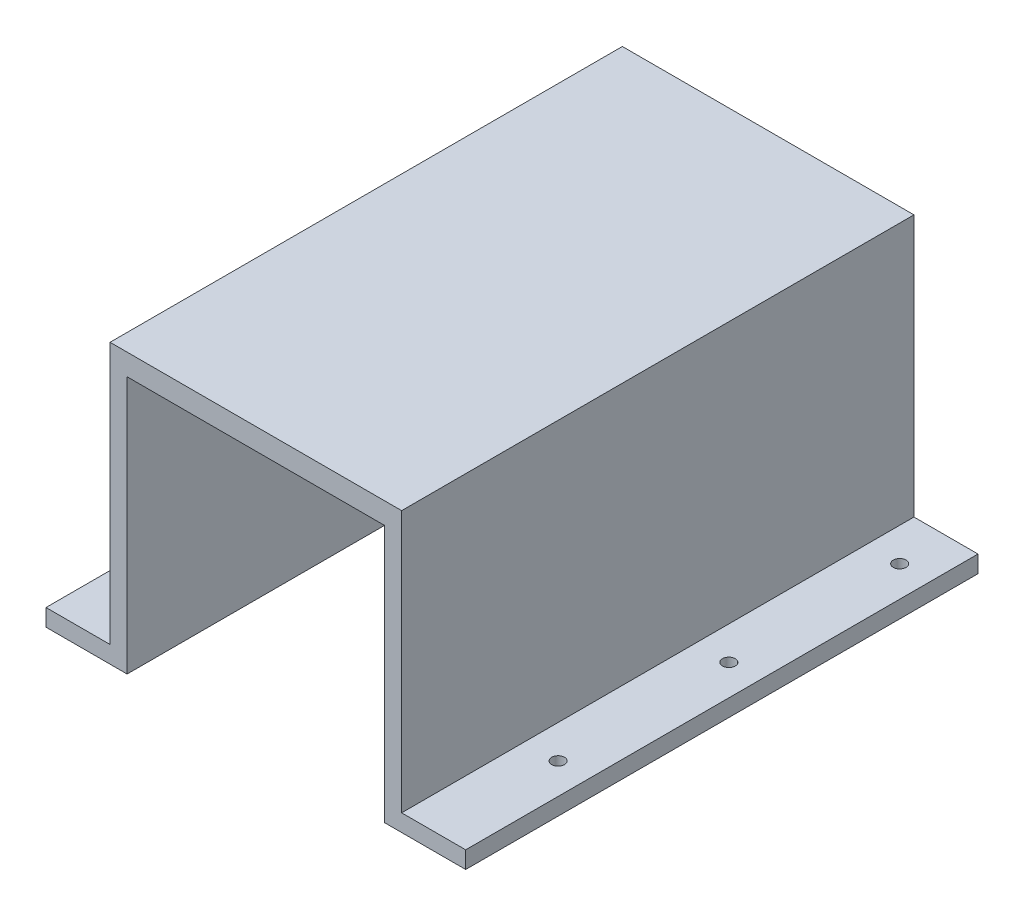
ISO-10303-21;
HEADER;
FILE_DESCRIPTION(('STEP AP214'),'2;1');
FILE_NAME('part.step','',(''),(''),'','','');
FILE_SCHEMA(('AUTOMOTIVE_DESIGN { 1 0 10303 214 1 1 1 1 }'));
ENDSEC;
DATA;
#1=APPLICATION_CONTEXT('core data for automotive mechanical design processes');
#2=APPLICATION_PROTOCOL_DEFINITION('international standard','automotive_design',2000,#1);
#3=PRODUCT_CONTEXT('',#1,'mechanical');
#4=PRODUCT('Part','Part','',(#3));
#5=PRODUCT_RELATED_PRODUCT_CATEGORY('part','',(#4));
#6=PRODUCT_DEFINITION_FORMATION('','',#4);
#7=PRODUCT_DEFINITION_CONTEXT('part definition',#1,'design');
#8=PRODUCT_DEFINITION('design','',#6,#7);
#9=PRODUCT_DEFINITION_SHAPE('','',#8);
#10=(LENGTH_UNIT() NAMED_UNIT(*) SI_UNIT(.MILLI.,.METRE.));
#11=(NAMED_UNIT(*) PLANE_ANGLE_UNIT() SI_UNIT($,.RADIAN.));
#12=(NAMED_UNIT(*) SI_UNIT($,.STERADIAN.) SOLID_ANGLE_UNIT());
#13=UNCERTAINTY_MEASURE_WITH_UNIT(LENGTH_MEASURE(1.E-05),#10,'distance_accuracy_value','');
#14=(GEOMETRIC_REPRESENTATION_CONTEXT(3) GLOBAL_UNCERTAINTY_ASSIGNED_CONTEXT((#13)) GLOBAL_UNIT_ASSIGNED_CONTEXT((#10,
#11,#12)) REPRESENTATION_CONTEXT('',''));
#15=CARTESIAN_POINT('',(0.,0.,0.));
#16=DIRECTION('',(0.,0.,1.));
#17=DIRECTION('',(1.,0.,0.));
#18=AXIS2_PLACEMENT_3D('',#15,#16,#17);
#19=CARTESIAN_POINT('',(-49.15,4.,-60.));
#20=DIRECTION('',(-1.,0.,0.));
#21=DIRECTION('',(0.,0.,1.));
#22=AXIS2_PLACEMENT_3D('',#19,#20,#21);
#23=PLANE('',#22);
#24=DIRECTION('',(0.,0.,1.));
#25=VECTOR('',#24,1.);
#26=CARTESIAN_POINT('',(-49.15,0.,-60.));
#27=LINE('',#26,#25);
#28=CARTESIAN_POINT('',(-49.15,0.,-60.));
#29=VERTEX_POINT('',#28);
#30=CARTESIAN_POINT('',(-49.15,0.,60.));
#31=VERTEX_POINT('',#30);
#32=EDGE_CURVE('E11',#29,#31,#27,.T.);
#33=ORIENTED_EDGE('',*,*,#32,.T.);
#34=DIRECTION('',(0.,-1.,0.));
#35=VECTOR('',#34,1.);
#36=CARTESIAN_POINT('',(-49.15,4.,60.));
#37=LINE('',#36,#35);
#38=CARTESIAN_POINT('',(-49.15,4.,60.));
#39=VERTEX_POINT('',#38);
#40=EDGE_CURVE('E138',#39,#31,#37,.T.);
#41=ORIENTED_EDGE('',*,*,#40,.F.);
#42=DIRECTION('',(0.,0.,1.));
#43=VECTOR('',#42,1.);
#44=CARTESIAN_POINT('',(-49.15,4.,-60.));
#45=LINE('',#44,#43);
#46=CARTESIAN_POINT('',(-49.15,4.,-60.));
#47=VERTEX_POINT('',#46);
#48=EDGE_CURVE('E43',#47,#39,#45,.T.);
#49=ORIENTED_EDGE('',*,*,#48,.F.);
#50=DIRECTION('',(0.,-1.,0.));
#51=VECTOR('',#50,1.);
#52=CARTESIAN_POINT('',(-49.15,4.,-60.));
#53=LINE('',#52,#51);
#54=EDGE_CURVE('E129',#47,#29,#53,.T.);
#55=ORIENTED_EDGE('',*,*,#54,.T.);
#56=EDGE_LOOP('',(#33,#41,#49,#55));
#57=FACE_BOUND('',#56,.T.);
#58=ADVANCED_FACE('F34',(#57),#23,.T.);
#59=CARTESIAN_POINT('',(-34.15,4.,-60.));
#60=DIRECTION('',(0.,1.,0.));
#61=DIRECTION('',(0.,0.,1.));
#62=AXIS2_PLACEMENT_3D('',#59,#60,#61);
#63=PLANE('',#62);
#64=CARTESIAN_POINT('',(-41.9465676307595,4.,31.14843605141));
#65=DIRECTION('',(0.,-1.,0.));
#66=DIRECTION('',(0.,0.,1.));
#67=AXIS2_PLACEMENT_3D('',#64,#65,#66);
#68=CIRCLE('',#67,1.5);
#69=CARTESIAN_POINT('',(-41.9465676307595,4.,32.64843605141));
#70=VERTEX_POINT('',#69);
#71=EDGE_CURVE('E328',#70,#70,#68,.T.);
#72=ORIENTED_EDGE('',*,*,#71,.T.);
#73=EDGE_LOOP('',(#72));
#74=FACE_BOUND('',#73,.T.);
#75=CARTESIAN_POINT('',(-41.9465676307595,4.,-8.85156394858996));
#76=DIRECTION('',(0.,-1.,0.));
#77=DIRECTION('',(0.,0.,1.));
#78=AXIS2_PLACEMENT_3D('',#75,#76,#77);
#79=CIRCLE('',#78,1.5);
#80=CARTESIAN_POINT('',(-41.9465676307595,4.,-7.35156394858995));
#81=VERTEX_POINT('',#80);
#82=EDGE_CURVE('E302',#81,#81,#79,.T.);
#83=ORIENTED_EDGE('',*,*,#82,.T.);
#84=EDGE_LOOP('',(#83));
#85=FACE_BOUND('',#84,.T.);
#86=CARTESIAN_POINT('',(-41.9465676307595,4.,-48.85156394859));
#87=DIRECTION('',(0.,-1.,0.));
#88=DIRECTION('',(0.,0.,1.));
#89=AXIS2_PLACEMENT_3D('',#86,#87,#88);
#90=CIRCLE('',#89,1.5);
#91=CARTESIAN_POINT('',(-41.9465676307595,4.,-47.35156394859));
#92=VERTEX_POINT('',#91);
#93=EDGE_CURVE('E303',#92,#92,#90,.T.);
#94=ORIENTED_EDGE('',*,*,#93,.T.);
#95=EDGE_LOOP('',(#94));
#96=FACE_BOUND('',#95,.T.);
#97=ORIENTED_EDGE('',*,*,#48,.T.);
#98=DIRECTION('',(-1.,0.,0.));
#99=VECTOR('',#98,1.);
#100=CARTESIAN_POINT('',(-34.15,4.,60.));
#101=LINE('',#100,#99);
#102=CARTESIAN_POINT('',(-34.15,4.,60.));
#103=VERTEX_POINT('',#102);
#104=EDGE_CURVE('E168',#103,#39,#101,.T.);
#105=ORIENTED_EDGE('',*,*,#104,.F.);
#106=DIRECTION('',(0.,0.,1.));
#107=VECTOR('',#106,1.);
#108=CARTESIAN_POINT('',(-34.15,4.,-60.));
#109=LINE('',#108,#107);
#110=CARTESIAN_POINT('',(-34.15,4.,-60.));
#111=VERTEX_POINT('',#110);
#112=EDGE_CURVE('E201',#111,#103,#109,.T.);
#113=ORIENTED_EDGE('',*,*,#112,.F.);
#114=DIRECTION('',(-1.,0.,0.));
#115=VECTOR('',#114,1.);
#116=CARTESIAN_POINT('',(-34.15,4.,-60.));
#117=LINE('',#116,#115);
#118=EDGE_CURVE('E197',#111,#47,#117,.T.);
#119=ORIENTED_EDGE('',*,*,#118,.T.);
#120=EDGE_LOOP('',(#97,#105,#113,#119));
#121=FACE_BOUND('',#120,.T.);
#122=ADVANCED_FACE('F253',(#74,#85,#96,#121),#63,.T.);
#123=CARTESIAN_POINT('',(-34.15,4.,-60.));
#124=DIRECTION('',(-1.,0.,0.));
#125=DIRECTION('',(0.,0.,1.));
#126=AXIS2_PLACEMENT_3D('',#123,#124,#125);
#127=PLANE('',#126);
#128=ORIENTED_EDGE('',*,*,#112,.T.);
#129=DIRECTION('',(0.,-1.,0.));
#130=VECTOR('',#129,1.);
#131=CARTESIAN_POINT('',(-34.15,4.,60.));
#132=LINE('',#131,#130);
#133=CARTESIAN_POINT('',(-34.15,65.3,60.));
#134=VERTEX_POINT('',#133);
#135=EDGE_CURVE('E165',#134,#103,#132,.T.);
#136=ORIENTED_EDGE('',*,*,#135,.F.);
#137=DIRECTION('',(0.,0.,1.));
#138=VECTOR('',#137,1.);
#139=CARTESIAN_POINT('',(-34.15,65.3,-60.));
#140=LINE('',#139,#138);
#141=CARTESIAN_POINT('',(-34.15,65.3,-60.));
#142=VERTEX_POINT('',#141);
#143=EDGE_CURVE('E203',#142,#134,#140,.T.);
#144=ORIENTED_EDGE('',*,*,#143,.F.);
#145=DIRECTION('',(0.,-1.,0.));
#146=VECTOR('',#145,1.);
#147=CARTESIAN_POINT('',(-34.15,4.,-60.));
#148=LINE('',#147,#146);
#149=EDGE_CURVE('E194',#142,#111,#148,.T.);
#150=ORIENTED_EDGE('',*,*,#149,.T.);
#151=EDGE_LOOP('',(#128,#136,#144,#150));
#152=FACE_BOUND('',#151,.T.);
#153=ADVANCED_FACE('F251',(#152),#127,.T.);
#154=CARTESIAN_POINT('',(-34.15,65.3,-60.));
#155=DIRECTION('',(0.,1.,0.));
#156=DIRECTION('',(-1.,0.,0.));
#157=AXIS2_PLACEMENT_3D('',#154,#155,#156);
#158=PLANE('',#157);
#159=ORIENTED_EDGE('',*,*,#143,.T.);
#160=DIRECTION('',(-1.,0.,0.));
#161=VECTOR('',#160,1.);
#162=CARTESIAN_POINT('',(-34.15,65.3,60.));
#163=LINE('',#162,#161);
#164=CARTESIAN_POINT('',(34.15,65.3,60.));
#165=VERTEX_POINT('',#164);
#166=EDGE_CURVE('E162',#165,#134,#163,.T.);
#167=ORIENTED_EDGE('',*,*,#166,.F.);
#168=DIRECTION('',(0.,0.,1.));
#169=VECTOR('',#168,1.);
#170=CARTESIAN_POINT('',(34.15,65.3,-60.));
#171=LINE('',#170,#169);
#172=CARTESIAN_POINT('',(34.15,65.3,-60.));
#173=VERTEX_POINT('',#172);
#174=EDGE_CURVE('E205',#173,#165,#171,.T.);
#175=ORIENTED_EDGE('',*,*,#174,.F.);
#176=DIRECTION('',(-1.,0.,0.));
#177=VECTOR('',#176,1.);
#178=CARTESIAN_POINT('',(-34.15,65.3,-60.));
#179=LINE('',#178,#177);
#180=EDGE_CURVE('E191',#173,#142,#179,.T.);
#181=ORIENTED_EDGE('',*,*,#180,.T.);
#182=EDGE_LOOP('',(#159,#167,#175,#181));
#183=FACE_BOUND('',#182,.T.);
#184=ADVANCED_FACE('F246',(#183),#158,.T.);
#185=CARTESIAN_POINT('',(34.15,4.,-60.));
#186=DIRECTION('',(1.,0.,0.));
#187=DIRECTION('',(0.,0.,-1.));
#188=AXIS2_PLACEMENT_3D('',#185,#186,#187);
#189=PLANE('',#188);
#190=ORIENTED_EDGE('',*,*,#174,.T.);
#191=DIRECTION('',(0.,1.,0.));
#192=VECTOR('',#191,1.);
#193=CARTESIAN_POINT('',(34.15,4.,60.));
#194=LINE('',#193,#192);
#195=CARTESIAN_POINT('',(34.15,4.,60.));
#196=VERTEX_POINT('',#195);
#197=EDGE_CURVE('E159',#196,#165,#194,.T.);
#198=ORIENTED_EDGE('',*,*,#197,.F.);
#199=DIRECTION('',(0.,0.,1.));
#200=VECTOR('',#199,1.);
#201=CARTESIAN_POINT('',(34.15,4.,-60.));
#202=LINE('',#201,#200);
#203=CARTESIAN_POINT('',(34.15,4.,-60.));
#204=VERTEX_POINT('',#203);
#205=EDGE_CURVE('E207',#204,#196,#202,.T.);
#206=ORIENTED_EDGE('',*,*,#205,.F.);
#207=DIRECTION('',(0.,1.,0.));
#208=VECTOR('',#207,1.);
#209=CARTESIAN_POINT('',(34.15,4.,-60.));
#210=LINE('',#209,#208);
#211=EDGE_CURVE('E188',#204,#173,#210,.T.);
#212=ORIENTED_EDGE('',*,*,#211,.T.);
#213=EDGE_LOOP('',(#190,#198,#206,#212));
#214=FACE_BOUND('',#213,.T.);
#215=ADVANCED_FACE('F241',(#214),#189,.T.);
#216=CARTESIAN_POINT('',(34.15,4.,-60.));
#217=DIRECTION('',(0.,1.,0.));
#218=DIRECTION('',(0.,0.,1.));
#219=AXIS2_PLACEMENT_3D('',#216,#217,#218);
#220=PLANE('',#219);
#221=CARTESIAN_POINT('',(41.9465676307595,4.,31.14843605141));
#222=DIRECTION('',(0.,1.,0.));
#223=DIRECTION('',(0.,0.,1.));
#224=AXIS2_PLACEMENT_3D('',#221,#222,#223);
#225=CIRCLE('',#224,1.5);
#226=CARTESIAN_POINT('',(41.9465676307595,4.,32.64843605141));
#227=VERTEX_POINT('',#226);
#228=EDGE_CURVE('E313',#227,#227,#225,.T.);
#229=ORIENTED_EDGE('',*,*,#228,.F.);
#230=EDGE_LOOP('',(#229));
#231=FACE_BOUND('',#230,.T.);
#232=CARTESIAN_POINT('',(41.9465676307595,4.,-8.85156394858996));
#233=DIRECTION('',(0.,1.,0.));
#234=DIRECTION('',(0.,0.,1.));
#235=AXIS2_PLACEMENT_3D('',#232,#233,#234);
#236=CIRCLE('',#235,1.5);
#237=CARTESIAN_POINT('',(41.9465676307595,4.,-7.35156394858995));
#238=VERTEX_POINT('',#237);
#239=EDGE_CURVE('E319',#238,#238,#236,.T.);
#240=ORIENTED_EDGE('',*,*,#239,.F.);
#241=EDGE_LOOP('',(#240));
#242=FACE_BOUND('',#241,.T.);
#243=CARTESIAN_POINT('',(41.9465676307595,4.,-48.85156394859));
#244=DIRECTION('',(0.,1.,0.));
#245=DIRECTION('',(0.,0.,1.));
#246=AXIS2_PLACEMENT_3D('',#243,#244,#245);
#247=CIRCLE('',#246,1.5);
#248=CARTESIAN_POINT('',(41.9465676307595,4.,-47.35156394859));
#249=VERTEX_POINT('',#248);
#250=EDGE_CURVE('E324',#249,#249,#247,.T.);
#251=ORIENTED_EDGE('',*,*,#250,.F.);
#252=EDGE_LOOP('',(#251));
#253=FACE_BOUND('',#252,.T.);
#254=ORIENTED_EDGE('',*,*,#205,.T.);
#255=DIRECTION('',(-1.,0.,0.));
#256=VECTOR('',#255,1.);
#257=CARTESIAN_POINT('',(34.15,4.,60.));
#258=LINE('',#257,#256);
#259=CARTESIAN_POINT('',(49.15,4.,60.));
#260=VERTEX_POINT('',#259);
#261=EDGE_CURVE('E156',#260,#196,#258,.T.);
#262=ORIENTED_EDGE('',*,*,#261,.F.);
#263=DIRECTION('',(0.,0.,1.));
#264=VECTOR('',#263,1.);
#265=CARTESIAN_POINT('',(49.15,4.,-60.));
#266=LINE('',#265,#264);
#267=CARTESIAN_POINT('',(49.15,4.,-60.));
#268=VERTEX_POINT('',#267);
#269=EDGE_CURVE('E209',#268,#260,#266,.T.);
#270=ORIENTED_EDGE('',*,*,#269,.F.);
#271=DIRECTION('',(-1.,0.,0.));
#272=VECTOR('',#271,1.);
#273=CARTESIAN_POINT('',(34.15,4.,-60.));
#274=LINE('',#273,#272);
#275=EDGE_CURVE('E185',#268,#204,#274,.T.);
#276=ORIENTED_EDGE('',*,*,#275,.T.);
#277=EDGE_LOOP('',(#254,#262,#270,#276));
#278=FACE_BOUND('',#277,.T.);
#279=ADVANCED_FACE('F239',(#231,#242,#253,#278),#220,.T.);
#280=CARTESIAN_POINT('',(49.15,4.,-60.));
#281=DIRECTION('',(1.,0.,0.));
#282=DIRECTION('',(0.,0.,-1.));
#283=AXIS2_PLACEMENT_3D('',#280,#281,#282);
#284=PLANE('',#283);
#285=ORIENTED_EDGE('',*,*,#269,.T.);
#286=DIRECTION('',(0.,1.,0.));
#287=VECTOR('',#286,1.);
#288=CARTESIAN_POINT('',(49.15,4.,60.));
#289=LINE('',#288,#287);
#290=CARTESIAN_POINT('',(49.15,0.,60.));
#291=VERTEX_POINT('',#290);
#292=EDGE_CURVE('E153',#291,#260,#289,.T.);
#293=ORIENTED_EDGE('',*,*,#292,.F.);
#294=DIRECTION('',(0.,0.,1.));
#295=VECTOR('',#294,1.);
#296=CARTESIAN_POINT('',(49.15,0.,-60.));
#297=LINE('',#296,#295);
#298=CARTESIAN_POINT('',(49.15,0.,-60.));
#299=VERTEX_POINT('',#298);
#300=EDGE_CURVE('E211',#299,#291,#297,.T.);
#301=ORIENTED_EDGE('',*,*,#300,.F.);
#302=DIRECTION('',(0.,1.,0.));
#303=VECTOR('',#302,1.);
#304=CARTESIAN_POINT('',(49.15,4.,-60.));
#305=LINE('',#304,#303);
#306=EDGE_CURVE('E182',#299,#268,#305,.T.);
#307=ORIENTED_EDGE('',*,*,#306,.T.);
#308=EDGE_LOOP('',(#285,#293,#301,#307));
#309=FACE_BOUND('',#308,.T.);
#310=ADVANCED_FACE('F234',(#309),#284,.T.);
#311=CARTESIAN_POINT('',(49.15,0.,-60.));
#312=DIRECTION('',(0.,-1.,0.));
#313=DIRECTION('',(0.,0.,-1.));
#314=AXIS2_PLACEMENT_3D('',#311,#312,#313);
#315=PLANE('',#314);
#316=CARTESIAN_POINT('',(41.9465676307595,0.,31.14843605141));
#317=DIRECTION('',(0.,1.,0.));
#318=DIRECTION('',(0.,0.,1.));
#319=AXIS2_PLACEMENT_3D('',#316,#317,#318);
#320=CIRCLE('',#319,1.5);
#321=CARTESIAN_POINT('',(41.9465676307595,0.,32.64843605141));
#322=VERTEX_POINT('',#321);
#323=EDGE_CURVE('E139',#322,#322,#320,.T.);
#324=ORIENTED_EDGE('',*,*,#323,.T.);
#325=EDGE_LOOP('',(#324));
#326=FACE_BOUND('',#325,.T.);
#327=CARTESIAN_POINT('',(41.9465676307595,0.,-8.85156394858996));
#328=DIRECTION('',(0.,1.,0.));
#329=DIRECTION('',(0.,0.,1.));
#330=AXIS2_PLACEMENT_3D('',#327,#328,#329);
#331=CIRCLE('',#330,1.5);
#332=CARTESIAN_POINT('',(41.9465676307595,0.,-7.35156394858995));
#333=VERTEX_POINT('',#332);
#334=EDGE_CURVE('E316',#333,#333,#331,.T.);
#335=ORIENTED_EDGE('',*,*,#334,.T.);
#336=EDGE_LOOP('',(#335));
#337=FACE_BOUND('',#336,.T.);
#338=CARTESIAN_POINT('',(41.9465676307595,0.,-48.85156394859));
#339=DIRECTION('',(0.,1.,0.));
#340=DIRECTION('',(0.,0.,1.));
#341=AXIS2_PLACEMENT_3D('',#338,#339,#340);
#342=CIRCLE('',#341,1.5);
#343=CARTESIAN_POINT('',(41.9465676307595,0.,-47.35156394859));
#344=VERTEX_POINT('',#343);
#345=EDGE_CURVE('E322',#344,#344,#342,.T.);
#346=ORIENTED_EDGE('',*,*,#345,.T.);
#347=EDGE_LOOP('',(#346));
#348=FACE_BOUND('',#347,.T.);
#349=ORIENTED_EDGE('',*,*,#300,.T.);
#350=DIRECTION('',(1.,0.,0.));
#351=VECTOR('',#350,1.);
#352=CARTESIAN_POINT('',(34.15,0.,60.));
#353=LINE('',#352,#351);
#354=CARTESIAN_POINT('',(30.15,0.,60.));
#355=VERTEX_POINT('',#354);
#356=EDGE_CURVE('E150',#355,#291,#353,.T.);
#357=ORIENTED_EDGE('',*,*,#356,.F.);
#358=DIRECTION('',(0.,0.,1.));
#359=VECTOR('',#358,1.);
#360=CARTESIAN_POINT('',(30.15,0.,-60.));
#361=LINE('',#360,#359);
#362=CARTESIAN_POINT('',(30.15,0.,-60.));
#363=VERTEX_POINT('',#362);
#364=EDGE_CURVE('E213',#363,#355,#361,.T.);
#365=ORIENTED_EDGE('',*,*,#364,.F.);
#366=DIRECTION('',(1.,0.,0.));
#367=VECTOR('',#366,1.);
#368=CARTESIAN_POINT('',(34.15,0.,-60.));
#369=LINE('',#368,#367);
#370=EDGE_CURVE('E180',#363,#299,#369,.T.);
#371=ORIENTED_EDGE('',*,*,#370,.T.);
#372=EDGE_LOOP('',(#349,#357,#365,#371));
#373=FACE_BOUND('',#372,.T.);
#374=ADVANCED_FACE('F226',(#326,#337,#348,#373),#315,.T.);
#375=CARTESIAN_POINT('',(30.15,0.,-60.));
#376=DIRECTION('',(-1.,0.,0.));
#377=DIRECTION('',(0.,0.,1.));
#378=AXIS2_PLACEMENT_3D('',#375,#376,#377);
#379=PLANE('',#378);
#380=ORIENTED_EDGE('',*,*,#364,.T.);
#381=DIRECTION('',(0.,-1.,0.));
#382=VECTOR('',#381,1.);
#383=CARTESIAN_POINT('',(30.15,0.,60.));
#384=LINE('',#383,#382);
#385=CARTESIAN_POINT('',(30.15,60.3,60.));
#386=VERTEX_POINT('',#385);
#387=EDGE_CURVE('E144',#386,#355,#384,.T.);
#388=ORIENTED_EDGE('',*,*,#387,.F.);
#389=DIRECTION('',(0.,0.,1.));
#390=VECTOR('',#389,1.);
#391=CARTESIAN_POINT('',(30.15,60.3,-60.));
#392=LINE('',#391,#390);
#393=CARTESIAN_POINT('',(30.15,60.3,-60.));
#394=VERTEX_POINT('',#393);
#395=EDGE_CURVE('E215',#394,#386,#392,.T.);
#396=ORIENTED_EDGE('',*,*,#395,.F.);
#397=DIRECTION('',(0.,-1.,0.));
#398=VECTOR('',#397,1.);
#399=CARTESIAN_POINT('',(30.15,0.,-60.));
#400=LINE('',#399,#398);
#401=EDGE_CURVE('E177',#394,#363,#400,.T.);
#402=ORIENTED_EDGE('',*,*,#401,.T.);
#403=EDGE_LOOP('',(#380,#388,#396,#402));
#404=FACE_BOUND('',#403,.T.);
#405=ADVANCED_FACE('F223',(#404),#379,.T.);
#406=CARTESIAN_POINT('',(-30.15,60.3,-60.));
#407=DIRECTION('',(0.,-1.,0.));
#408=DIRECTION('',(0.,0.,-1.));
#409=AXIS2_PLACEMENT_3D('',#406,#407,#408);
#410=PLANE('',#409);
#411=ORIENTED_EDGE('',*,*,#395,.T.);
#412=DIRECTION('',(1.,0.,0.));
#413=VECTOR('',#412,1.);
#414=CARTESIAN_POINT('',(-30.15,60.3,60.));
#415=LINE('',#414,#413);
#416=CARTESIAN_POINT('',(-30.15,60.3,60.));
#417=VERTEX_POINT('',#416);
#418=EDGE_CURVE('E142',#417,#386,#415,.T.);
#419=ORIENTED_EDGE('',*,*,#418,.F.);
#420=DIRECTION('',(0.,0.,1.));
#421=VECTOR('',#420,1.);
#422=CARTESIAN_POINT('',(-30.15,60.3,-60.));
#423=LINE('',#422,#421);
#424=CARTESIAN_POINT('',(-30.15,60.3,-60.));
#425=VERTEX_POINT('',#424);
#426=EDGE_CURVE('E128',#425,#417,#423,.T.);
#427=ORIENTED_EDGE('',*,*,#426,.F.);
#428=DIRECTION('',(1.,0.,0.));
#429=VECTOR('',#428,1.);
#430=CARTESIAN_POINT('',(-30.15,60.3,-60.));
#431=LINE('',#430,#429);
#432=EDGE_CURVE('E174',#425,#394,#431,.T.);
#433=ORIENTED_EDGE('',*,*,#432,.T.);
#434=EDGE_LOOP('',(#411,#419,#427,#433));
#435=FACE_BOUND('',#434,.T.);
#436=ADVANCED_FACE('F217',(#435),#410,.T.);
#437=CARTESIAN_POINT('',(-30.15,0.,-60.));
#438=DIRECTION('',(1.,0.,0.));
#439=DIRECTION('',(0.,0.,-1.));
#440=AXIS2_PLACEMENT_3D('',#437,#438,#439);
#441=PLANE('',#440);
#442=ORIENTED_EDGE('',*,*,#426,.T.);
#443=DIRECTION('',(0.,1.,0.));
#444=VECTOR('',#443,1.);
#445=CARTESIAN_POINT('',(-30.15,0.,60.));
#446=LINE('',#445,#444);
#447=CARTESIAN_POINT('',(-30.15,0.,60.));
#448=VERTEX_POINT('',#447);
#449=EDGE_CURVE('E135',#448,#417,#446,.T.);
#450=ORIENTED_EDGE('',*,*,#449,.F.);
#451=DIRECTION('',(0.,0.,1.));
#452=VECTOR('',#451,1.);
#453=CARTESIAN_POINT('',(-30.15,0.,-60.));
#454=LINE('',#453,#452);
#455=CARTESIAN_POINT('',(-30.15,0.,-60.));
#456=VERTEX_POINT('',#455);
#457=EDGE_CURVE('E38',#456,#448,#454,.T.);
#458=ORIENTED_EDGE('',*,*,#457,.F.);
#459=DIRECTION('',(0.,1.,0.));
#460=VECTOR('',#459,1.);
#461=CARTESIAN_POINT('',(-30.15,0.,-60.));
#462=LINE('',#461,#460);
#463=EDGE_CURVE('E172',#456,#425,#462,.T.);
#464=ORIENTED_EDGE('',*,*,#463,.T.);
#465=EDGE_LOOP('',(#442,#450,#458,#464));
#466=FACE_BOUND('',#465,.T.);
#467=ADVANCED_FACE('F141',(#466),#441,.T.);
#468=CARTESIAN_POINT('',(-34.15,0.,-60.));
#469=DIRECTION('',(0.,-1.,0.));
#470=DIRECTION('',(0.,0.,-1.));
#471=AXIS2_PLACEMENT_3D('',#468,#469,#470);
#472=PLANE('',#471);
#473=CARTESIAN_POINT('',(-41.9465676307595,0.,31.14843605141));
#474=DIRECTION('',(0.,-1.,0.));
#475=DIRECTION('',(0.,0.,1.));
#476=AXIS2_PLACEMENT_3D('',#473,#474,#475);
#477=CIRCLE('',#476,1.5);
#478=CARTESIAN_POINT('',(-41.9465676307595,0.,32.64843605141));
#479=VERTEX_POINT('',#478);
#480=EDGE_CURVE('E293',#479,#479,#477,.T.);
#481=ORIENTED_EDGE('',*,*,#480,.F.);
#482=EDGE_LOOP('',(#481));
#483=FACE_BOUND('',#482,.T.);
#484=CARTESIAN_POINT('',(-41.9465676307595,0.,-8.85156394858996));
#485=DIRECTION('',(0.,-1.,0.));
#486=DIRECTION('',(0.,0.,1.));
#487=AXIS2_PLACEMENT_3D('',#484,#485,#486);
#488=CIRCLE('',#487,1.5);
#489=CARTESIAN_POINT('',(-41.9465676307595,0.,-7.35156394858995));
#490=VERTEX_POINT('',#489);
#491=EDGE_CURVE('E297',#490,#490,#488,.T.);
#492=ORIENTED_EDGE('',*,*,#491,.F.);
#493=EDGE_LOOP('',(#492));
#494=FACE_BOUND('',#493,.T.);
#495=CARTESIAN_POINT('',(-41.9465676307595,0.,-48.85156394859));
#496=DIRECTION('',(0.,-1.,0.));
#497=DIRECTION('',(0.,0.,1.));
#498=AXIS2_PLACEMENT_3D('',#495,#496,#497);
#499=CIRCLE('',#498,1.5);
#500=CARTESIAN_POINT('',(-41.9465676307595,0.,-47.35156394859));
#501=VERTEX_POINT('',#500);
#502=EDGE_CURVE('E300',#501,#501,#499,.T.);
#503=ORIENTED_EDGE('',*,*,#502,.F.);
#504=EDGE_LOOP('',(#503));
#505=FACE_BOUND('',#504,.T.);
#506=ORIENTED_EDGE('',*,*,#457,.T.);
#507=DIRECTION('',(1.,0.,0.));
#508=VECTOR('',#507,1.);
#509=CARTESIAN_POINT('',(-49.15,0.,60.));
#510=LINE('',#509,#508);
#511=EDGE_CURVE('E122',#31,#448,#510,.T.);
#512=ORIENTED_EDGE('',*,*,#511,.F.);
#513=ORIENTED_EDGE('',*,*,#32,.F.);
#514=DIRECTION('',(1.,0.,0.));
#515=VECTOR('',#514,1.);
#516=CARTESIAN_POINT('',(-49.15,0.,-60.));
#517=LINE('',#516,#515);
#518=EDGE_CURVE('E123',#29,#456,#517,.T.);
#519=ORIENTED_EDGE('',*,*,#518,.T.);
#520=EDGE_LOOP('',(#506,#512,#513,#519));
#521=FACE_BOUND('',#520,.T.);
#522=ADVANCED_FACE('F36',(#483,#494,#505,#521),#472,.T.);
#523=CARTESIAN_POINT('',(0.,0.,-60.));
#524=DIRECTION('',(0.,0.,1.));
#525=DIRECTION('',(1.,0.,0.));
#526=AXIS2_PLACEMENT_3D('',#523,#524,#525);
#527=PLANE('',#526);
#528=ORIENTED_EDGE('',*,*,#518,.F.);
#529=ORIENTED_EDGE('',*,*,#54,.F.);
#530=ORIENTED_EDGE('',*,*,#118,.F.);
#531=ORIENTED_EDGE('',*,*,#149,.F.);
#532=ORIENTED_EDGE('',*,*,#180,.F.);
#533=ORIENTED_EDGE('',*,*,#211,.F.);
#534=ORIENTED_EDGE('',*,*,#275,.F.);
#535=ORIENTED_EDGE('',*,*,#306,.F.);
#536=ORIENTED_EDGE('',*,*,#370,.F.);
#537=ORIENTED_EDGE('',*,*,#401,.F.);
#538=ORIENTED_EDGE('',*,*,#432,.F.);
#539=ORIENTED_EDGE('',*,*,#463,.F.);
#540=EDGE_LOOP('',(#528,#529,#530,#531,#532,#533,#534,#535,#536,#537,#538,#539));
#541=FACE_BOUND('',#540,.T.);
#542=ADVANCED_FACE('F230',(#541),#527,.F.);
#543=CARTESIAN_POINT('',(0.,0.,60.));
#544=DIRECTION('',(0.,0.,1.));
#545=DIRECTION('',(1.,0.,0.));
#546=AXIS2_PLACEMENT_3D('',#543,#544,#545);
#547=PLANE('',#546);
#548=ORIENTED_EDGE('',*,*,#511,.T.);
#549=ORIENTED_EDGE('',*,*,#449,.T.);
#550=ORIENTED_EDGE('',*,*,#418,.T.);
#551=ORIENTED_EDGE('',*,*,#387,.T.);
#552=ORIENTED_EDGE('',*,*,#356,.T.);
#553=ORIENTED_EDGE('',*,*,#292,.T.);
#554=ORIENTED_EDGE('',*,*,#261,.T.);
#555=ORIENTED_EDGE('',*,*,#197,.T.);
#556=ORIENTED_EDGE('',*,*,#166,.T.);
#557=ORIENTED_EDGE('',*,*,#135,.T.);
#558=ORIENTED_EDGE('',*,*,#104,.T.);
#559=ORIENTED_EDGE('',*,*,#40,.T.);
#560=EDGE_LOOP('',(#548,#549,#550,#551,#552,#553,#554,#555,#556,#557,#558,#559));
#561=FACE_BOUND('',#560,.T.);
#562=ADVANCED_FACE('F133',(#561),#547,.T.);
#563=CARTESIAN_POINT('',(41.9465676307595,0.,-48.85156394859));
#564=DIRECTION('',(0.,1.,0.));
#565=DIRECTION('',(0.,0.,1.));
#566=AXIS2_PLACEMENT_3D('',#563,#564,#565);
#567=CYLINDRICAL_SURFACE('',#566,1.5);
#568=ORIENTED_EDGE('',*,*,#345,.F.);
#569=EDGE_LOOP('',(#568));
#570=FACE_BOUND('',#569,.T.);
#571=ORIENTED_EDGE('',*,*,#250,.T.);
#572=EDGE_LOOP('',(#571));
#573=FACE_BOUND('',#572,.T.);
#574=ADVANCED_FACE('F358',(#570,#573),#567,.F.);
#575=CARTESIAN_POINT('',(41.9465676307595,0.,-8.85156394858996));
#576=DIRECTION('',(0.,1.,0.));
#577=DIRECTION('',(0.,0.,1.));
#578=AXIS2_PLACEMENT_3D('',#575,#576,#577);
#579=CYLINDRICAL_SURFACE('',#578,1.5);
#580=ORIENTED_EDGE('',*,*,#334,.F.);
#581=EDGE_LOOP('',(#580));
#582=FACE_BOUND('',#581,.T.);
#583=ORIENTED_EDGE('',*,*,#239,.T.);
#584=EDGE_LOOP('',(#583));
#585=FACE_BOUND('',#584,.T.);
#586=ADVANCED_FACE('F351',(#582,#585),#579,.F.);
#587=CARTESIAN_POINT('',(41.9465676307595,0.,31.14843605141));
#588=DIRECTION('',(0.,1.,0.));
#589=DIRECTION('',(0.,0.,1.));
#590=AXIS2_PLACEMENT_3D('',#587,#588,#589);
#591=CYLINDRICAL_SURFACE('',#590,1.5);
#592=ORIENTED_EDGE('',*,*,#323,.F.);
#593=EDGE_LOOP('',(#592));
#594=FACE_BOUND('',#593,.T.);
#595=ORIENTED_EDGE('',*,*,#228,.T.);
#596=EDGE_LOOP('',(#595));
#597=FACE_BOUND('',#596,.T.);
#598=ADVANCED_FACE('F346',(#594,#597),#591,.F.);
#599=CARTESIAN_POINT('',(-41.9465676307595,0.,-48.85156394859));
#600=DIRECTION('',(0.,1.,0.));
#601=DIRECTION('',(0.,0.,1.));
#602=AXIS2_PLACEMENT_3D('',#599,#600,#601);
#603=CYLINDRICAL_SURFACE('',#602,1.5);
#604=ORIENTED_EDGE('',*,*,#502,.T.);
#605=EDGE_LOOP('',(#604));
#606=FACE_BOUND('',#605,.T.);
#607=ORIENTED_EDGE('',*,*,#93,.F.);
#608=EDGE_LOOP('',(#607));
#609=FACE_BOUND('',#608,.T.);
#610=ADVANCED_FACE('F338',(#606,#609),#603,.F.);
#611=CARTESIAN_POINT('',(-41.9465676307595,0.,-8.85156394858996));
#612=DIRECTION('',(0.,1.,0.));
#613=DIRECTION('',(0.,0.,1.));
#614=AXIS2_PLACEMENT_3D('',#611,#612,#613);
#615=CYLINDRICAL_SURFACE('',#614,1.5);
#616=ORIENTED_EDGE('',*,*,#491,.T.);
#617=EDGE_LOOP('',(#616));
#618=FACE_BOUND('',#617,.T.);
#619=ORIENTED_EDGE('',*,*,#82,.F.);
#620=EDGE_LOOP('',(#619));
#621=FACE_BOUND('',#620,.T.);
#622=ADVANCED_FACE('F334',(#618,#621),#615,.F.);
#623=CARTESIAN_POINT('',(-41.9465676307595,0.,31.14843605141));
#624=DIRECTION('',(0.,1.,0.));
#625=DIRECTION('',(0.,0.,1.));
#626=AXIS2_PLACEMENT_3D('',#623,#624,#625);
#627=CYLINDRICAL_SURFACE('',#626,1.5);
#628=ORIENTED_EDGE('',*,*,#480,.T.);
#629=EDGE_LOOP('',(#628));
#630=FACE_BOUND('',#629,.T.);
#631=ORIENTED_EDGE('',*,*,#71,.F.);
#632=EDGE_LOOP('',(#631));
#633=FACE_BOUND('',#632,.T.);
#634=ADVANCED_FACE('F337',(#630,#633),#627,.F.);
#635=CLOSED_SHELL('',(#58,#122,#153,#184,#215,#279,#310,#374,#405,#436,#467,#522,#542,#562,#574,
#586,#598,#610,#622,#634));
#636=MANIFOLD_SOLID_BREP('B2',#635);
#637=ADVANCED_BREP_SHAPE_REPRESENTATION('',(#18,#636),#14);
#638=SHAPE_DEFINITION_REPRESENTATION(#9,#637);
ENDSEC;
END-ISO-10303-21;
